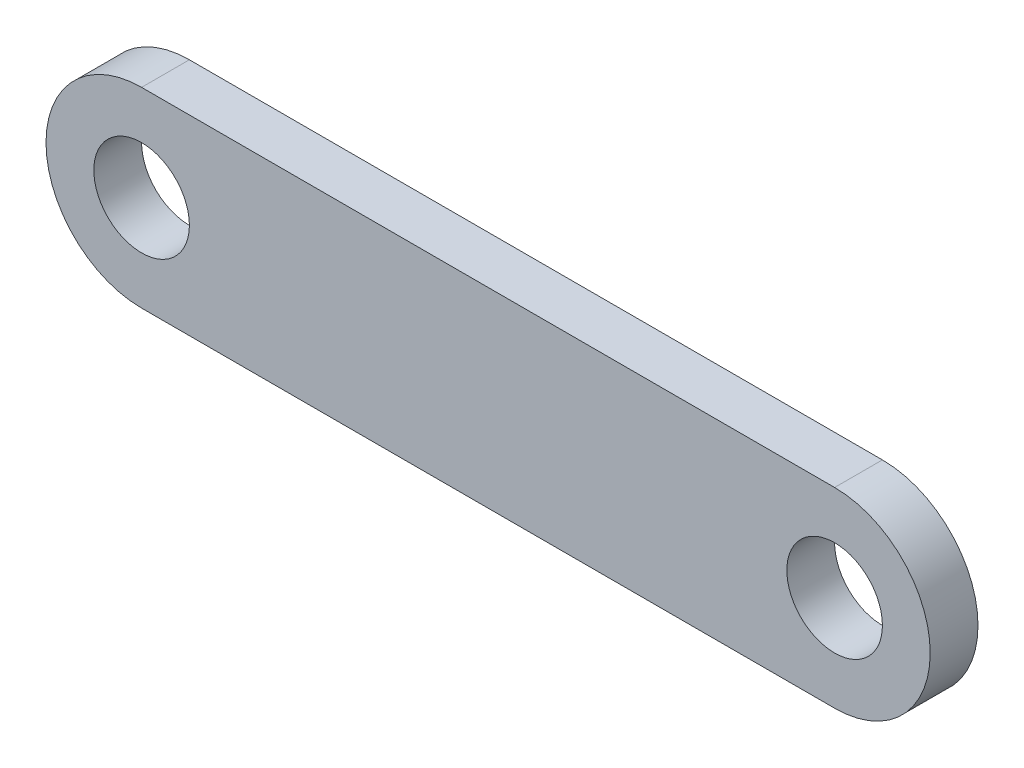
ISO-10303-21;
HEADER;
FILE_DESCRIPTION(('STEP AP214'),'2;1');
FILE_NAME('part.step','',(''),(''),'','','');
FILE_SCHEMA(('AUTOMOTIVE_DESIGN { 1 0 10303 214 1 1 1 1 }'));
ENDSEC;
DATA;
#1=APPLICATION_CONTEXT('core data for automotive mechanical design processes');
#2=APPLICATION_PROTOCOL_DEFINITION('international standard','automotive_design',2000,#1);
#3=PRODUCT_CONTEXT('',#1,'mechanical');
#4=PRODUCT('Part','Part','',(#3));
#5=PRODUCT_RELATED_PRODUCT_CATEGORY('part','',(#4));
#6=PRODUCT_DEFINITION_FORMATION('','',#4);
#7=PRODUCT_DEFINITION_CONTEXT('part definition',#1,'design');
#8=PRODUCT_DEFINITION('design','',#6,#7);
#9=PRODUCT_DEFINITION_SHAPE('','',#8);
#10=(LENGTH_UNIT() NAMED_UNIT(*) SI_UNIT(.MILLI.,.METRE.));
#11=(NAMED_UNIT(*) PLANE_ANGLE_UNIT() SI_UNIT($,.RADIAN.));
#12=(NAMED_UNIT(*) SI_UNIT($,.STERADIAN.) SOLID_ANGLE_UNIT());
#13=UNCERTAINTY_MEASURE_WITH_UNIT(LENGTH_MEASURE(1.E-05),#10,'distance_accuracy_value','');
#14=(GEOMETRIC_REPRESENTATION_CONTEXT(3) GLOBAL_UNCERTAINTY_ASSIGNED_CONTEXT((#13)) GLOBAL_UNIT_ASSIGNED_CONTEXT((#10,
#11,#12)) REPRESENTATION_CONTEXT('',''));
#15=CARTESIAN_POINT('',(0.,0.,0.));
#16=DIRECTION('',(0.,0.,1.));
#17=DIRECTION('',(1.,0.,0.));
#18=AXIS2_PLACEMENT_3D('',#15,#16,#17);
#19=CARTESIAN_POINT('',(0.,0.,2.54));
#20=DIRECTION('',(0.,0.,1.));
#21=DIRECTION('',(1.,0.,0.));
#22=AXIS2_PLACEMENT_3D('',#19,#20,#21);
#23=PLANE('',#22);
#24=CARTESIAN_POINT('',(-36.83,0.,2.54));
#25=DIRECTION('',(0.,0.,1.));
#26=DIRECTION('',(1.,0.,0.));
#27=AXIS2_PLACEMENT_3D('',#24,#25,#26);
#28=CIRCLE('',#27,2.54);
#29=CARTESIAN_POINT('',(-34.29,0.,2.54));
#30=VERTEX_POINT('',#29);
#31=EDGE_CURVE('E101',#30,#30,#28,.T.);
#32=ORIENTED_EDGE('',*,*,#31,.F.);
#33=EDGE_LOOP('',(#32));
#34=FACE_BOUND('',#33,.T.);
#35=CARTESIAN_POINT('',(0.,0.,2.54));
#36=DIRECTION('',(0.,0.,1.));
#37=DIRECTION('',(1.,0.,0.));
#38=AXIS2_PLACEMENT_3D('',#35,#36,#37);
#39=CIRCLE('',#38,5.08);
#40=CARTESIAN_POINT('',(0.,-5.08,2.54));
#41=VERTEX_POINT('',#40);
#42=CARTESIAN_POINT('',(0.,5.08,2.54));
#43=VERTEX_POINT('',#42);
#44=EDGE_CURVE('E86',#41,#43,#39,.T.);
#45=ORIENTED_EDGE('',*,*,#44,.T.);
#46=DIRECTION('',(-1.,0.,0.));
#47=VECTOR('',#46,1.);
#48=CARTESIAN_POINT('',(0.,5.08,2.54));
#49=LINE('',#48,#47);
#50=CARTESIAN_POINT('',(-36.83,5.08,2.54));
#51=VERTEX_POINT('',#50);
#52=EDGE_CURVE('E81',#43,#51,#49,.T.);
#53=ORIENTED_EDGE('',*,*,#52,.T.);
#54=CARTESIAN_POINT('',(-36.83,0.,2.54));
#55=DIRECTION('',(0.,0.,1.));
#56=DIRECTION('',(1.,0.,0.));
#57=AXIS2_PLACEMENT_3D('',#54,#55,#56);
#58=CIRCLE('',#57,5.08);
#59=CARTESIAN_POINT('',(-36.83,-5.08,2.54));
#60=VERTEX_POINT('',#59);
#61=EDGE_CURVE('E84',#51,#60,#58,.T.);
#62=ORIENTED_EDGE('',*,*,#61,.T.);
#63=DIRECTION('',(1.,0.,0.));
#64=VECTOR('',#63,1.);
#65=CARTESIAN_POINT('',(0.,-5.08,2.54));
#66=LINE('',#65,#64);
#67=EDGE_CURVE('E51',#60,#41,#66,.T.);
#68=ORIENTED_EDGE('',*,*,#67,.T.);
#69=EDGE_LOOP('',(#45,#53,#62,#68));
#70=FACE_BOUND('',#69,.T.);
#71=CARTESIAN_POINT('',(0.,0.,2.54));
#72=DIRECTION('',(0.,0.,1.));
#73=DIRECTION('',(1.,0.,0.));
#74=AXIS2_PLACEMENT_3D('',#71,#72,#73);
#75=CIRCLE('',#74,2.54);
#76=CARTESIAN_POINT('',(2.54,0.,2.54));
#77=VERTEX_POINT('',#76);
#78=EDGE_CURVE('E116',#77,#77,#75,.T.);
#79=ORIENTED_EDGE('',*,*,#78,.F.);
#80=EDGE_LOOP('',(#79));
#81=FACE_BOUND('',#80,.T.);
#82=ADVANCED_FACE('F34',(#34,#70,#81),#23,.T.);
#83=CARTESIAN_POINT('',(0.,0.,0.));
#84=DIRECTION('',(0.,0.,1.));
#85=DIRECTION('',(1.,0.,0.));
#86=AXIS2_PLACEMENT_3D('',#83,#84,#85);
#87=PLANE('',#86);
#88=CARTESIAN_POINT('',(0.,0.,0.));
#89=DIRECTION('',(0.,0.,1.));
#90=DIRECTION('',(1.,0.,0.));
#91=AXIS2_PLACEMENT_3D('',#88,#89,#90);
#92=CIRCLE('',#91,5.08);
#93=CARTESIAN_POINT('',(0.,-5.08,0.));
#94=VERTEX_POINT('',#93);
#95=CARTESIAN_POINT('',(0.,5.08,0.));
#96=VERTEX_POINT('',#95);
#97=EDGE_CURVE('E98',#94,#96,#92,.T.);
#98=ORIENTED_EDGE('',*,*,#97,.F.);
#99=DIRECTION('',(1.,0.,0.));
#100=VECTOR('',#99,1.);
#101=CARTESIAN_POINT('',(0.,-5.08,0.));
#102=LINE('',#101,#100);
#103=CARTESIAN_POINT('',(-36.83,-5.08,0.));
#104=VERTEX_POINT('',#103);
#105=EDGE_CURVE('E74',#104,#94,#102,.T.);
#106=ORIENTED_EDGE('',*,*,#105,.F.);
#107=CARTESIAN_POINT('',(-36.83,0.,0.));
#108=DIRECTION('',(0.,0.,1.));
#109=DIRECTION('',(1.,0.,0.));
#110=AXIS2_PLACEMENT_3D('',#107,#108,#109);
#111=CIRCLE('',#110,5.08);
#112=CARTESIAN_POINT('',(-36.83,5.08,0.));
#113=VERTEX_POINT('',#112);
#114=EDGE_CURVE('E68',#113,#104,#111,.T.);
#115=ORIENTED_EDGE('',*,*,#114,.F.);
#116=DIRECTION('',(-1.,0.,0.));
#117=VECTOR('',#116,1.);
#118=CARTESIAN_POINT('',(0.,5.08,0.));
#119=LINE('',#118,#117);
#120=EDGE_CURVE('E90',#96,#113,#119,.T.);
#121=ORIENTED_EDGE('',*,*,#120,.F.);
#122=EDGE_LOOP('',(#98,#106,#115,#121));
#123=FACE_BOUND('',#122,.T.);
#124=CARTESIAN_POINT('',(-36.83,0.,0.));
#125=DIRECTION('',(0.,0.,1.));
#126=DIRECTION('',(1.,0.,0.));
#127=AXIS2_PLACEMENT_3D('',#124,#125,#126);
#128=CIRCLE('',#127,2.54);
#129=CARTESIAN_POINT('',(-34.29,0.,0.));
#130=VERTEX_POINT('',#129);
#131=EDGE_CURVE('E113',#130,#130,#128,.T.);
#132=ORIENTED_EDGE('',*,*,#131,.T.);
#133=EDGE_LOOP('',(#132));
#134=FACE_BOUND('',#133,.T.);
#135=CARTESIAN_POINT('',(0.,0.,0.));
#136=DIRECTION('',(0.,0.,1.));
#137=DIRECTION('',(1.,0.,0.));
#138=AXIS2_PLACEMENT_3D('',#135,#136,#137);
#139=CIRCLE('',#138,2.54);
#140=CARTESIAN_POINT('',(2.54,0.,0.));
#141=VERTEX_POINT('',#140);
#142=EDGE_CURVE('E119',#141,#141,#139,.T.);
#143=ORIENTED_EDGE('',*,*,#142,.T.);
#144=EDGE_LOOP('',(#143));
#145=FACE_BOUND('',#144,.T.);
#146=ADVANCED_FACE('F109',(#123,#134,#145),#87,.F.);
#147=CARTESIAN_POINT('',(0.,0.,2.54));
#148=DIRECTION('',(0.,0.,-1.));
#149=DIRECTION('',(-1.,0.,0.));
#150=AXIS2_PLACEMENT_3D('',#147,#148,#149);
#151=CYLINDRICAL_SURFACE('',#150,5.08);
#152=ORIENTED_EDGE('',*,*,#97,.T.);
#153=DIRECTION('',(0.,0.,-1.));
#154=VECTOR('',#153,1.);
#155=CARTESIAN_POINT('',(0.,5.08,2.54));
#156=LINE('',#155,#154);
#157=EDGE_CURVE('E11',#43,#96,#156,.T.);
#158=ORIENTED_EDGE('',*,*,#157,.F.);
#159=ORIENTED_EDGE('',*,*,#44,.F.);
#160=DIRECTION('',(0.,0.,-1.));
#161=VECTOR('',#160,1.);
#162=CARTESIAN_POINT('',(0.,-5.08,2.54));
#163=LINE('',#162,#161);
#164=EDGE_CURVE('E94',#41,#94,#163,.T.);
#165=ORIENTED_EDGE('',*,*,#164,.T.);
#166=EDGE_LOOP('',(#152,#158,#159,#165));
#167=FACE_BOUND('',#166,.T.);
#168=ADVANCED_FACE('F36',(#167),#151,.T.);
#169=CARTESIAN_POINT('',(0.,5.08,2.54));
#170=DIRECTION('',(0.,-1.,0.));
#171=DIRECTION('',(1.,0.,0.));
#172=AXIS2_PLACEMENT_3D('',#169,#170,#171);
#173=PLANE('',#172);
#174=ORIENTED_EDGE('',*,*,#120,.T.);
#175=DIRECTION('',(0.,0.,-1.));
#176=VECTOR('',#175,1.);
#177=CARTESIAN_POINT('',(-36.83,5.08,2.54));
#178=LINE('',#177,#176);
#179=EDGE_CURVE('E43',#51,#113,#178,.T.);
#180=ORIENTED_EDGE('',*,*,#179,.F.);
#181=ORIENTED_EDGE('',*,*,#52,.F.);
#182=ORIENTED_EDGE('',*,*,#157,.T.);
#183=EDGE_LOOP('',(#174,#180,#181,#182));
#184=FACE_BOUND('',#183,.T.);
#185=ADVANCED_FACE('F89',(#184),#173,.F.);
#186=CARTESIAN_POINT('',(-36.83,0.,2.54));
#187=DIRECTION('',(0.,0.,-1.));
#188=DIRECTION('',(-1.,0.,0.));
#189=AXIS2_PLACEMENT_3D('',#186,#187,#188);
#190=CYLINDRICAL_SURFACE('',#189,5.08);
#191=ORIENTED_EDGE('',*,*,#114,.T.);
#192=DIRECTION('',(0.,0.,-1.));
#193=VECTOR('',#192,1.);
#194=CARTESIAN_POINT('',(-36.83,-5.08,2.54));
#195=LINE('',#194,#193);
#196=EDGE_CURVE('E91',#60,#104,#195,.T.);
#197=ORIENTED_EDGE('',*,*,#196,.F.);
#198=ORIENTED_EDGE('',*,*,#61,.F.);
#199=ORIENTED_EDGE('',*,*,#179,.T.);
#200=EDGE_LOOP('',(#191,#197,#198,#199));
#201=FACE_BOUND('',#200,.T.);
#202=ADVANCED_FACE('F92',(#201),#190,.T.);
#203=CARTESIAN_POINT('',(0.,-5.08,2.54));
#204=DIRECTION('',(0.,1.,0.));
#205=DIRECTION('',(-1.,0.,0.));
#206=AXIS2_PLACEMENT_3D('',#203,#204,#205);
#207=PLANE('',#206);
#208=ORIENTED_EDGE('',*,*,#105,.T.);
#209=ORIENTED_EDGE('',*,*,#164,.F.);
#210=ORIENTED_EDGE('',*,*,#67,.F.);
#211=ORIENTED_EDGE('',*,*,#196,.T.);
#212=EDGE_LOOP('',(#208,#209,#210,#211));
#213=FACE_BOUND('',#212,.T.);
#214=ADVANCED_FACE('F106',(#213),#207,.F.);
#215=CARTESIAN_POINT('',(-36.83,0.,2.54));
#216=DIRECTION('',(0.,0.,-1.));
#217=DIRECTION('',(-1.,0.,0.));
#218=AXIS2_PLACEMENT_3D('',#215,#216,#217);
#219=CYLINDRICAL_SURFACE('',#218,2.54);
#220=ORIENTED_EDGE('',*,*,#31,.T.);
#221=EDGE_LOOP('',(#220));
#222=FACE_BOUND('',#221,.T.);
#223=ORIENTED_EDGE('',*,*,#131,.F.);
#224=EDGE_LOOP('',(#223));
#225=FACE_BOUND('',#224,.T.);
#226=ADVANCED_FACE('F136',(#222,#225),#219,.F.);
#227=CARTESIAN_POINT('',(0.,0.,2.54));
#228=DIRECTION('',(0.,0.,-1.));
#229=DIRECTION('',(-1.,0.,0.));
#230=AXIS2_PLACEMENT_3D('',#227,#228,#229);
#231=CYLINDRICAL_SURFACE('',#230,2.54);
#232=ORIENTED_EDGE('',*,*,#78,.T.);
#233=EDGE_LOOP('',(#232));
#234=FACE_BOUND('',#233,.T.);
#235=ORIENTED_EDGE('',*,*,#142,.F.);
#236=EDGE_LOOP('',(#235));
#237=FACE_BOUND('',#236,.T.);
#238=ADVANCED_FACE('F125',(#234,#237),#231,.F.);
#239=CLOSED_SHELL('',(#82,#146,#168,#185,#202,#214,#226,#238));
#240=MANIFOLD_SOLID_BREP('B2',#239);
#241=ADVANCED_BREP_SHAPE_REPRESENTATION('',(#18,#240),#14);
#242=SHAPE_DEFINITION_REPRESENTATION(#9,#241);
ENDSEC;
END-ISO-10303-21;
